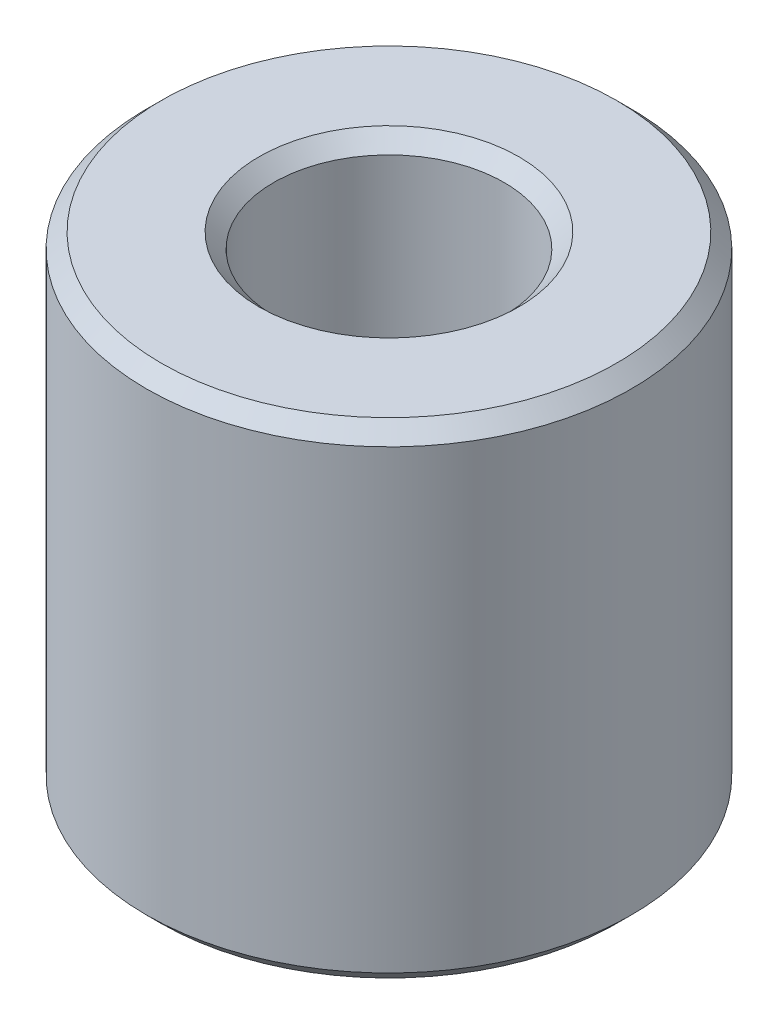
ISO-10303-21;
HEADER;
FILE_DESCRIPTION(('STEP AP214'),'2;1');
FILE_NAME('part.step','',(''),(''),'','','');
FILE_SCHEMA(('AUTOMOTIVE_DESIGN { 1 0 10303 214 1 1 1 1 }'));
ENDSEC;
DATA;
#1=APPLICATION_CONTEXT('core data for automotive mechanical design processes');
#2=APPLICATION_PROTOCOL_DEFINITION('international standard','automotive_design',2000,#1);
#3=PRODUCT_CONTEXT('',#1,'mechanical');
#4=PRODUCT('Part','Part','',(#3));
#5=PRODUCT_RELATED_PRODUCT_CATEGORY('part','',(#4));
#6=PRODUCT_DEFINITION_FORMATION('','',#4);
#7=PRODUCT_DEFINITION_CONTEXT('part definition',#1,'design');
#8=PRODUCT_DEFINITION('design','',#6,#7);
#9=PRODUCT_DEFINITION_SHAPE('','',#8);
#10=(LENGTH_UNIT() NAMED_UNIT(*) SI_UNIT(.MILLI.,.METRE.));
#11=(NAMED_UNIT(*) PLANE_ANGLE_UNIT() SI_UNIT($,.RADIAN.));
#12=(NAMED_UNIT(*) SI_UNIT($,.STERADIAN.) SOLID_ANGLE_UNIT());
#13=UNCERTAINTY_MEASURE_WITH_UNIT(LENGTH_MEASURE(1.E-05),#10,'distance_accuracy_value','');
#14=(GEOMETRIC_REPRESENTATION_CONTEXT(3) GLOBAL_UNCERTAINTY_ASSIGNED_CONTEXT((#13)) GLOBAL_UNIT_ASSIGNED_CONTEXT((#10,
#11,#12)) REPRESENTATION_CONTEXT('',''));
#15=CARTESIAN_POINT('',(0.,0.,0.));
#16=DIRECTION('',(0.,0.,1.));
#17=DIRECTION('',(1.,0.,0.));
#18=AXIS2_PLACEMENT_3D('',#15,#16,#17);
#19=CARTESIAN_POINT('',(0.,100.081244841635,0.));
#20=DIRECTION('',(0.,-1.,0.));
#21=DIRECTION('',(0.,0.,-1.));
#22=AXIS2_PLACEMENT_3D('',#19,#20,#21);
#23=CYLINDRICAL_SURFACE('',#22,50.);
#24=CARTESIAN_POINT('',(0.,3.05661501660064,0.));
#25=DIRECTION('',(0.,1.,0.));
#26=DIRECTION('',(0.,0.,1.));
#27=AXIS2_PLACEMENT_3D('',#24,#25,#26);
#28=CIRCLE('',#27,50.);
#29=CARTESIAN_POINT('',(0.,3.05661501660064,50.));
#30=VERTEX_POINT('',#29);
#31=EDGE_CURVE('E10',#30,#30,#28,.T.);
#32=ORIENTED_EDGE('',*,*,#31,.T.);
#33=EDGE_LOOP('',(#32));
#34=FACE_BOUND('',#33,.T.);
#35=CARTESIAN_POINT('',(0.,97.0246298250346,0.));
#36=DIRECTION('',(0.,1.,0.));
#37=DIRECTION('',(0.,0.,1.));
#38=AXIS2_PLACEMENT_3D('',#35,#36,#37);
#39=CIRCLE('',#38,50.);
#40=CARTESIAN_POINT('',(0.,97.0246298250346,50.));
#41=VERTEX_POINT('',#40);
#42=EDGE_CURVE('E50',#41,#41,#39,.F.);
#43=ORIENTED_EDGE('',*,*,#42,.T.);
#44=EDGE_LOOP('',(#43));
#45=FACE_BOUND('',#44,.T.);
#46=ADVANCED_FACE('F39',(#34,#45),#23,.T.);
#47=CARTESIAN_POINT('',(0.,100.081244841635,0.));
#48=DIRECTION('',(0.,1.,0.));
#49=DIRECTION('',(0.,0.,1.));
#50=AXIS2_PLACEMENT_3D('',#47,#48,#49);
#51=PLANE('',#50);
#52=CARTESIAN_POINT('',(0.,100.081244841635,0.));
#53=DIRECTION('',(0.,1.,0.));
#54=DIRECTION('',(0.,0.,1.));
#55=AXIS2_PLACEMENT_3D('',#52,#53,#54);
#56=CIRCLE('',#55,26.8174346899417);
#57=CARTESIAN_POINT('',(0.,100.081244841635,26.8174346899417));
#58=VERTEX_POINT('',#57);
#59=EDGE_CURVE('E58',#58,#58,#56,.F.);
#60=ORIENTED_EDGE('',*,*,#59,.T.);
#61=EDGE_LOOP('',(#60));
#62=FACE_BOUND('',#61,.T.);
#63=CARTESIAN_POINT('',(0.,100.081244841635,0.));
#64=DIRECTION('',(0.,1.,0.));
#65=DIRECTION('',(0.,0.,1.));
#66=AXIS2_PLACEMENT_3D('',#63,#64,#65);
#67=CIRCLE('',#66,46.9433849833993);
#68=CARTESIAN_POINT('',(0.,100.081244841635,46.9433849833993));
#69=VERTEX_POINT('',#68);
#70=EDGE_CURVE('E61',#69,#69,#67,.T.);
#71=ORIENTED_EDGE('',*,*,#70,.T.);
#72=EDGE_LOOP('',(#71));
#73=FACE_BOUND('',#72,.T.);
#74=ADVANCED_FACE('F88',(#62,#73),#51,.T.);
#75=CARTESIAN_POINT('',(0.,0.,0.));
#76=DIRECTION('',(0.,1.,0.));
#77=DIRECTION('',(0.,0.,1.));
#78=AXIS2_PLACEMENT_3D('',#75,#76,#77);
#79=PLANE('',#78);
#80=CARTESIAN_POINT('',(0.,0.,0.));
#81=DIRECTION('',(0.,1.,0.));
#82=DIRECTION('',(0.,0.,1.));
#83=AXIS2_PLACEMENT_3D('',#80,#81,#82);
#84=CIRCLE('',#83,26.8174346899417);
#85=CARTESIAN_POINT('',(0.,0.,26.8174346899417));
#86=VERTEX_POINT('',#85);
#87=EDGE_CURVE('E51',#86,#86,#84,.T.);
#88=ORIENTED_EDGE('',*,*,#87,.T.);
#89=EDGE_LOOP('',(#88));
#90=FACE_BOUND('',#89,.T.);
#91=CARTESIAN_POINT('',(0.,0.,0.));
#92=DIRECTION('',(0.,1.,0.));
#93=DIRECTION('',(0.,0.,1.));
#94=AXIS2_PLACEMENT_3D('',#91,#92,#93);
#95=CIRCLE('',#94,46.9433849833994);
#96=CARTESIAN_POINT('',(0.,0.,46.9433849833994));
#97=VERTEX_POINT('',#96);
#98=EDGE_CURVE('E54',#97,#97,#95,.F.);
#99=ORIENTED_EDGE('',*,*,#98,.T.);
#100=EDGE_LOOP('',(#99));
#101=FACE_BOUND('',#100,.T.);
#102=ADVANCED_FACE('F83',(#90,#101),#79,.F.);
#103=CARTESIAN_POINT('',(0.,100.081244841635,0.));
#104=DIRECTION('',(0.,-1.,0.));
#105=DIRECTION('',(0.,0.,-1.));
#106=AXIS2_PLACEMENT_3D('',#103,#104,#105);
#107=CYLINDRICAL_SURFACE('',#106,23.760819673341);
#108=CARTESIAN_POINT('',(0.,97.0246298250346,0.));
#109=DIRECTION('',(0.,1.,0.));
#110=DIRECTION('',(0.,0.,1.));
#111=AXIS2_PLACEMENT_3D('',#108,#109,#110);
#112=CIRCLE('',#111,23.760819673341);
#113=CARTESIAN_POINT('',(0.,97.0246298250346,23.760819673341));
#114=VERTEX_POINT('',#113);
#115=EDGE_CURVE('E67',#114,#114,#112,.T.);
#116=ORIENTED_EDGE('',*,*,#115,.T.);
#117=EDGE_LOOP('',(#116));
#118=FACE_BOUND('',#117,.T.);
#119=CARTESIAN_POINT('',(0.,3.05661501660069,0.));
#120=DIRECTION('',(0.,1.,0.));
#121=DIRECTION('',(0.,0.,1.));
#122=AXIS2_PLACEMENT_3D('',#119,#120,#121);
#123=CIRCLE('',#122,23.760819673341);
#124=CARTESIAN_POINT('',(0.,3.05661501660069,23.760819673341));
#125=VERTEX_POINT('',#124);
#126=EDGE_CURVE('E69',#125,#125,#123,.F.);
#127=ORIENTED_EDGE('',*,*,#126,.T.);
#128=EDGE_LOOP('',(#127));
#129=FACE_BOUND('',#128,.T.);
#130=ADVANCED_FACE('F71',(#118,#129),#107,.F.);
#131=CARTESIAN_POINT('',(0.,97.0246298250346,0.));
#132=DIRECTION('',(0.,1.,0.));
#133=DIRECTION('',(0.,0.,1.));
#134=AXIS2_PLACEMENT_3D('',#131,#132,#133);
#135=CONICAL_SURFACE('',#134,23.760819673341,0.785398163397451);
#136=ORIENTED_EDGE('',*,*,#59,.F.);
#137=EDGE_LOOP('',(#136));
#138=FACE_BOUND('',#137,.T.);
#139=ORIENTED_EDGE('',*,*,#115,.F.);
#140=EDGE_LOOP('',(#139));
#141=FACE_BOUND('',#140,.T.);
#142=ADVANCED_FACE('F77',(#138,#141),#135,.F.);
#143=CARTESIAN_POINT('',(0.,0.,0.));
#144=DIRECTION('',(0.,-1.,0.));
#145=DIRECTION('',(0.,0.,-1.));
#146=AXIS2_PLACEMENT_3D('',#143,#144,#145);
#147=CONICAL_SURFACE('',#146,26.8174346899417,0.785398163397447);
#148=ORIENTED_EDGE('',*,*,#126,.F.);
#149=EDGE_LOOP('',(#148));
#150=FACE_BOUND('',#149,.T.);
#151=ORIENTED_EDGE('',*,*,#87,.F.);
#152=EDGE_LOOP('',(#151));
#153=FACE_BOUND('',#152,.T.);
#154=ADVANCED_FACE('F73',(#150,#153),#147,.F.);
#155=CARTESIAN_POINT('',(0.,3.05661501660064,0.));
#156=DIRECTION('',(0.,1.,0.));
#157=DIRECTION('',(0.,0.,1.));
#158=AXIS2_PLACEMENT_3D('',#155,#156,#157);
#159=CONICAL_SURFACE('',#158,50.,0.785398163397449);
#160=ORIENTED_EDGE('',*,*,#98,.F.);
#161=EDGE_LOOP('',(#160));
#162=FACE_BOUND('',#161,.T.);
#163=ORIENTED_EDGE('',*,*,#31,.F.);
#164=EDGE_LOOP('',(#163));
#165=FACE_BOUND('',#164,.T.);
#166=ADVANCED_FACE('F76',(#162,#165),#159,.T.);
#167=CARTESIAN_POINT('',(0.,100.081244841635,0.));
#168=DIRECTION('',(0.,-1.,0.));
#169=DIRECTION('',(0.,0.,-1.));
#170=AXIS2_PLACEMENT_3D('',#167,#168,#169);
#171=CONICAL_SURFACE('',#170,46.9433849833993,0.785398163397446);
#172=ORIENTED_EDGE('',*,*,#42,.F.);
#173=EDGE_LOOP('',(#172));
#174=FACE_BOUND('',#173,.T.);
#175=ORIENTED_EDGE('',*,*,#70,.F.);
#176=EDGE_LOOP('',(#175));
#177=FACE_BOUND('',#176,.T.);
#178=ADVANCED_FACE('F45',(#174,#177),#171,.T.);
#179=CLOSED_SHELL('',(#46,#74,#102,#130,#142,#154,#166,#178));
#180=MANIFOLD_SOLID_BREP('B2',#179);
#181=ADVANCED_BREP_SHAPE_REPRESENTATION('',(#18,#180),#14);
#182=SHAPE_DEFINITION_REPRESENTATION(#9,#181);
ENDSEC;
END-ISO-10303-21;
